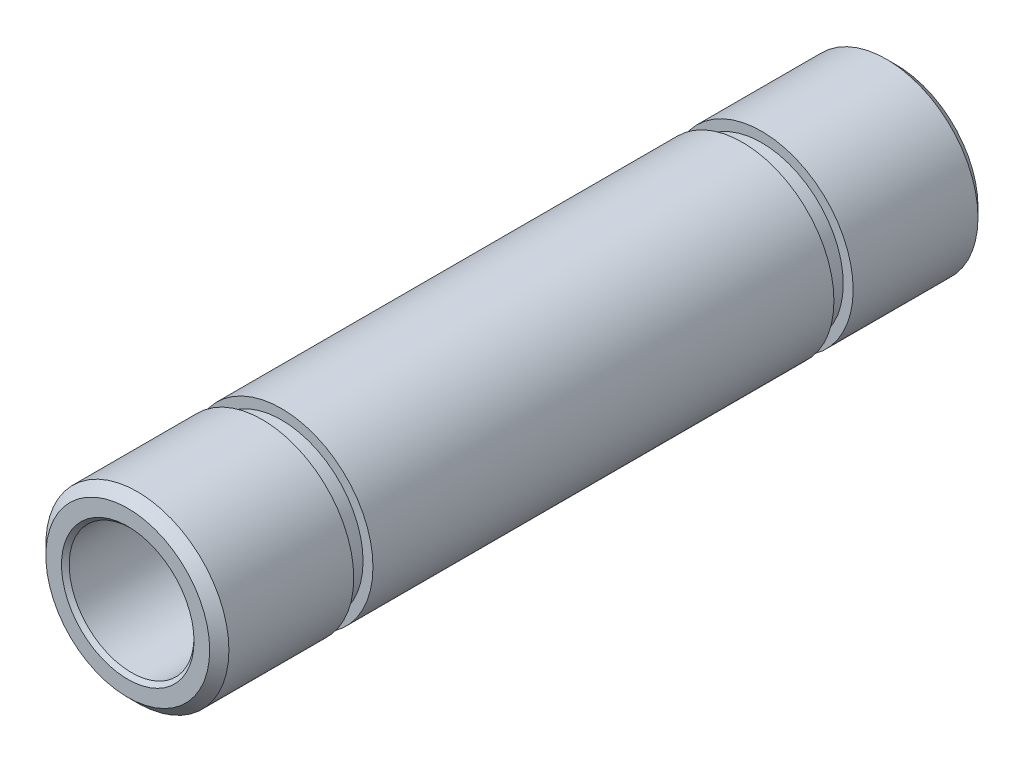
ISO-10303-21;
HEADER;
FILE_DESCRIPTION(('STEP AP214'),'2;1');
FILE_NAME('part.step','',(''),(''),'','','');
FILE_SCHEMA(('AUTOMOTIVE_DESIGN { 1 0 10303 214 1 1 1 1 }'));
ENDSEC;
DATA;
#1=APPLICATION_CONTEXT('core data for automotive mechanical design processes');
#2=APPLICATION_PROTOCOL_DEFINITION('international standard','automotive_design',2000,#1);
#3=PRODUCT_CONTEXT('',#1,'mechanical');
#4=PRODUCT('Part','Part','',(#3));
#5=PRODUCT_RELATED_PRODUCT_CATEGORY('part','',(#4));
#6=PRODUCT_DEFINITION_FORMATION('','',#4);
#7=PRODUCT_DEFINITION_CONTEXT('part definition',#1,'design');
#8=PRODUCT_DEFINITION('design','',#6,#7);
#9=PRODUCT_DEFINITION_SHAPE('','',#8);
#10=(LENGTH_UNIT() NAMED_UNIT(*) SI_UNIT(.MILLI.,.METRE.));
#11=(NAMED_UNIT(*) PLANE_ANGLE_UNIT() SI_UNIT($,.RADIAN.));
#12=(NAMED_UNIT(*) SI_UNIT($,.STERADIAN.) SOLID_ANGLE_UNIT());
#13=UNCERTAINTY_MEASURE_WITH_UNIT(LENGTH_MEASURE(1.E-05),#10,'distance_accuracy_value','');
#14=(GEOMETRIC_REPRESENTATION_CONTEXT(3) GLOBAL_UNCERTAINTY_ASSIGNED_CONTEXT((#13)) GLOBAL_UNIT_ASSIGNED_CONTEXT((#10,
#11,#12)) REPRESENTATION_CONTEXT('',''));
#15=CARTESIAN_POINT('',(0.,0.,0.));
#16=DIRECTION('',(0.,0.,1.));
#17=DIRECTION('',(1.,0.,0.));
#18=AXIS2_PLACEMENT_3D('',#15,#16,#17);
#19=CARTESIAN_POINT('',(0.,0.,-40.));
#20=DIRECTION('',(0.,0.,1.));
#21=DIRECTION('',(1.,0.,0.));
#22=AXIS2_PLACEMENT_3D('',#19,#20,#21);
#23=CYLINDRICAL_SURFACE('',#22,4.765);
#24=CARTESIAN_POINT('',(0.,0.,-39.5));
#25=DIRECTION('',(0.,0.,1.));
#26=DIRECTION('',(1.,0.,0.));
#27=AXIS2_PLACEMENT_3D('',#24,#25,#26);
#28=CIRCLE('',#27,4.765);
#29=CARTESIAN_POINT('',(4.765,0.,-39.5));
#30=VERTEX_POINT('',#29);
#31=EDGE_CURVE('E36',#30,#30,#28,.T.);
#32=ORIENTED_EDGE('',*,*,#31,.T.);
#33=EDGE_LOOP('',(#32));
#34=FACE_BOUND('',#33,.T.);
#35=CARTESIAN_POINT('',(0.,0.,-33.));
#36=DIRECTION('',(0.,0.,1.));
#37=DIRECTION('',(1.,0.,0.));
#38=AXIS2_PLACEMENT_3D('',#35,#36,#37);
#39=CIRCLE('',#38,4.765);
#40=CARTESIAN_POINT('',(4.765,0.,-33.));
#41=VERTEX_POINT('',#40);
#42=EDGE_CURVE('E58',#41,#41,#39,.T.);
#43=ORIENTED_EDGE('',*,*,#42,.F.);
#44=EDGE_LOOP('',(#43));
#45=FACE_BOUND('',#44,.T.);
#46=ADVANCED_FACE('F13',(#34,#45),#23,.T.);
#47=CARTESIAN_POINT('',(0.,0.,-32.));
#48=DIRECTION('',(0.,0.,1.));
#49=DIRECTION('',(1.,0.,0.));
#50=AXIS2_PLACEMENT_3D('',#47,#48,#49);
#51=CIRCLE('',#50,4.765);
#52=CARTESIAN_POINT('',(4.765,0.,-32.));
#53=VERTEX_POINT('',#52);
#54=EDGE_CURVE('E55',#53,#53,#51,.T.);
#55=ORIENTED_EDGE('',*,*,#54,.T.);
#56=EDGE_LOOP('',(#55));
#57=FACE_BOUND('',#56,.T.);
#58=CARTESIAN_POINT('',(0.,0.,-8.));
#59=DIRECTION('',(0.,0.,1.));
#60=DIRECTION('',(1.,0.,0.));
#61=AXIS2_PLACEMENT_3D('',#58,#59,#60);
#62=CIRCLE('',#61,4.765);
#63=CARTESIAN_POINT('',(4.765,0.,-8.));
#64=VERTEX_POINT('',#63);
#65=EDGE_CURVE('E45',#64,#64,#62,.T.);
#66=ORIENTED_EDGE('',*,*,#65,.F.);
#67=EDGE_LOOP('',(#66));
#68=FACE_BOUND('',#67,.T.);
#69=ADVANCED_FACE('F92',(#57,#68),#23,.T.);
#70=CARTESIAN_POINT('',(0.,0.,-0.500000000000007));
#71=DIRECTION('',(0.,0.,1.));
#72=DIRECTION('',(1.,0.,0.));
#73=AXIS2_PLACEMENT_3D('',#70,#71,#72);
#74=CIRCLE('',#73,4.765);
#75=CARTESIAN_POINT('',(4.765,0.,-0.500000000000007));
#76=VERTEX_POINT('',#75);
#77=EDGE_CURVE('E39',#76,#76,#74,.F.);
#78=ORIENTED_EDGE('',*,*,#77,.T.);
#79=EDGE_LOOP('',(#78));
#80=FACE_BOUND('',#79,.T.);
#81=CARTESIAN_POINT('',(0.,0.,-7.));
#82=DIRECTION('',(0.,0.,1.));
#83=DIRECTION('',(1.,0.,0.));
#84=AXIS2_PLACEMENT_3D('',#81,#82,#83);
#85=CIRCLE('',#84,4.765);
#86=CARTESIAN_POINT('',(4.765,0.,-7.));
#87=VERTEX_POINT('',#86);
#88=EDGE_CURVE('E46',#87,#87,#85,.T.);
#89=ORIENTED_EDGE('',*,*,#88,.T.);
#90=EDGE_LOOP('',(#89));
#91=FACE_BOUND('',#90,.T.);
#92=ADVANCED_FACE('F95',(#80,#91),#23,.T.);
#93=CARTESIAN_POINT('',(0.,0.,-40.));
#94=DIRECTION('',(0.,0.,1.));
#95=DIRECTION('',(1.,0.,0.));
#96=AXIS2_PLACEMENT_3D('',#93,#94,#95);
#97=PLANE('',#96);
#98=CARTESIAN_POINT('',(0.,0.,-40.));
#99=DIRECTION('',(0.,0.,1.));
#100=DIRECTION('',(1.,0.,0.));
#101=AXIS2_PLACEMENT_3D('',#98,#99,#100);
#102=CIRCLE('',#101,3.44999999999999);
#103=CARTESIAN_POINT('',(3.44999999999999,0.,-40.));
#104=VERTEX_POINT('',#103);
#105=EDGE_CURVE('E20',#104,#104,#102,.T.);
#106=ORIENTED_EDGE('',*,*,#105,.T.);
#107=EDGE_LOOP('',(#106));
#108=FACE_BOUND('',#107,.T.);
#109=CARTESIAN_POINT('',(0.,0.,-40.));
#110=DIRECTION('',(0.,0.,1.));
#111=DIRECTION('',(1.,0.,0.));
#112=AXIS2_PLACEMENT_3D('',#109,#110,#111);
#113=CIRCLE('',#112,4.26499999999999);
#114=CARTESIAN_POINT('',(4.26499999999999,0.,-40.));
#115=VERTEX_POINT('',#114);
#116=EDGE_CURVE('E33',#115,#115,#113,.F.);
#117=ORIENTED_EDGE('',*,*,#116,.T.);
#118=EDGE_LOOP('',(#117));
#119=FACE_BOUND('',#118,.T.);
#120=ADVANCED_FACE('F104',(#108,#119),#97,.F.);
#121=CARTESIAN_POINT('',(0.,0.,0.));
#122=DIRECTION('',(0.,0.,1.));
#123=DIRECTION('',(1.,0.,0.));
#124=AXIS2_PLACEMENT_3D('',#121,#122,#123);
#125=PLANE('',#124);
#126=CARTESIAN_POINT('',(0.,0.,0.));
#127=DIRECTION('',(0.,0.,1.));
#128=DIRECTION('',(1.,0.,0.));
#129=AXIS2_PLACEMENT_3D('',#126,#127,#128);
#130=CIRCLE('',#129,3.45000000000001);
#131=CARTESIAN_POINT('',(3.45000000000001,0.,0.));
#132=VERTEX_POINT('',#131);
#133=EDGE_CURVE('E24',#132,#132,#130,.F.);
#134=ORIENTED_EDGE('',*,*,#133,.T.);
#135=EDGE_LOOP('',(#134));
#136=FACE_BOUND('',#135,.T.);
#137=CARTESIAN_POINT('',(0.,0.,0.));
#138=DIRECTION('',(0.,0.,1.));
#139=DIRECTION('',(1.,0.,0.));
#140=AXIS2_PLACEMENT_3D('',#137,#138,#139);
#141=CIRCLE('',#140,4.265);
#142=CARTESIAN_POINT('',(4.265,0.,0.));
#143=VERTEX_POINT('',#142);
#144=EDGE_CURVE('E42',#143,#143,#141,.T.);
#145=ORIENTED_EDGE('',*,*,#144,.T.);
#146=EDGE_LOOP('',(#145));
#147=FACE_BOUND('',#146,.T.);
#148=ADVANCED_FACE('F109',(#136,#147),#125,.T.);
#149=CARTESIAN_POINT('',(0.,0.,-40.));
#150=DIRECTION('',(0.,0.,1.));
#151=DIRECTION('',(1.,0.,0.));
#152=AXIS2_PLACEMENT_3D('',#149,#150,#151);
#153=CYLINDRICAL_SURFACE('',#152,3.25);
#154=CARTESIAN_POINT('',(0.,0.,-39.8));
#155=DIRECTION('',(0.,0.,1.));
#156=DIRECTION('',(1.,0.,0.));
#157=AXIS2_PLACEMENT_3D('',#154,#155,#156);
#158=CIRCLE('',#157,3.25);
#159=CARTESIAN_POINT('',(3.25,0.,-39.8));
#160=VERTEX_POINT('',#159);
#161=EDGE_CURVE('E9',#160,#160,#158,.F.);
#162=ORIENTED_EDGE('',*,*,#161,.T.);
#163=EDGE_LOOP('',(#162));
#164=FACE_BOUND('',#163,.T.);
#165=CARTESIAN_POINT('',(0.,0.,-0.200000000000006));
#166=DIRECTION('',(0.,0.,1.));
#167=DIRECTION('',(1.,0.,0.));
#168=AXIS2_PLACEMENT_3D('',#165,#166,#167);
#169=CIRCLE('',#168,3.25);
#170=CARTESIAN_POINT('',(3.25,0.,-0.200000000000006));
#171=VERTEX_POINT('',#170);
#172=EDGE_CURVE('E28',#171,#171,#169,.T.);
#173=ORIENTED_EDGE('',*,*,#172,.T.);
#174=EDGE_LOOP('',(#173));
#175=FACE_BOUND('',#174,.T.);
#176=ADVANCED_FACE('F125',(#164,#175),#153,.F.);
#177=CARTESIAN_POINT('',(0.,0.,-8.));
#178=DIRECTION('',(0.,0.,1.));
#179=DIRECTION('',(1.,0.,0.));
#180=AXIS2_PLACEMENT_3D('',#177,#178,#179);
#181=PLANE('',#180);
#182=CARTESIAN_POINT('',(0.,0.,-8.));
#183=DIRECTION('',(0.,0.,1.));
#184=DIRECTION('',(1.,0.,0.));
#185=AXIS2_PLACEMENT_3D('',#182,#183,#184);
#186=CIRCLE('',#185,4.25);
#187=CARTESIAN_POINT('',(4.25,0.,-8.));
#188=VERTEX_POINT('',#187);
#189=EDGE_CURVE('E49',#188,#188,#186,.T.);
#190=ORIENTED_EDGE('',*,*,#189,.F.);
#191=EDGE_LOOP('',(#190));
#192=FACE_BOUND('',#191,.T.);
#193=ORIENTED_EDGE('',*,*,#65,.T.);
#194=EDGE_LOOP('',(#193));
#195=FACE_BOUND('',#194,.T.);
#196=ADVANCED_FACE('F117',(#192,#195),#181,.T.);
#197=CARTESIAN_POINT('',(0.,0.,-7.));
#198=DIRECTION('',(0.,0.,1.));
#199=DIRECTION('',(1.,0.,0.));
#200=AXIS2_PLACEMENT_3D('',#197,#198,#199);
#201=PLANE('',#200);
#202=CARTESIAN_POINT('',(0.,0.,-7.));
#203=DIRECTION('',(0.,0.,1.));
#204=DIRECTION('',(1.,0.,0.));
#205=AXIS2_PLACEMENT_3D('',#202,#203,#204);
#206=CIRCLE('',#205,4.25);
#207=CARTESIAN_POINT('',(4.25,0.,-7.));
#208=VERTEX_POINT('',#207);
#209=EDGE_CURVE('E52',#208,#208,#206,.T.);
#210=ORIENTED_EDGE('',*,*,#209,.T.);
#211=EDGE_LOOP('',(#210));
#212=FACE_BOUND('',#211,.T.);
#213=ORIENTED_EDGE('',*,*,#88,.F.);
#214=EDGE_LOOP('',(#213));
#215=FACE_BOUND('',#214,.T.);
#216=ADVANCED_FACE('F115',(#212,#215),#201,.F.);
#217=CARTESIAN_POINT('',(0.,0.,-8.));
#218=DIRECTION('',(0.,0.,1.));
#219=DIRECTION('',(1.,0.,0.));
#220=AXIS2_PLACEMENT_3D('',#217,#218,#219);
#221=CYLINDRICAL_SURFACE('',#220,4.25);
#222=ORIENTED_EDGE('',*,*,#189,.T.);
#223=EDGE_LOOP('',(#222));
#224=FACE_BOUND('',#223,.T.);
#225=ORIENTED_EDGE('',*,*,#209,.F.);
#226=EDGE_LOOP('',(#225));
#227=FACE_BOUND('',#226,.T.);
#228=ADVANCED_FACE('F87',(#224,#227),#221,.T.);
#229=CARTESIAN_POINT('',(0.,0.,-32.));
#230=DIRECTION('',(0.,0.,1.));
#231=DIRECTION('',(1.,0.,0.));
#232=AXIS2_PLACEMENT_3D('',#229,#230,#231);
#233=PLANE('',#232);
#234=ORIENTED_EDGE('',*,*,#54,.F.);
#235=EDGE_LOOP('',(#234));
#236=FACE_BOUND('',#235,.T.);
#237=CARTESIAN_POINT('',(0.,0.,-32.));
#238=DIRECTION('',(0.,0.,1.));
#239=DIRECTION('',(1.,0.,0.));
#240=AXIS2_PLACEMENT_3D('',#237,#238,#239);
#241=CIRCLE('',#240,4.25);
#242=CARTESIAN_POINT('',(4.25,0.,-32.));
#243=VERTEX_POINT('',#242);
#244=EDGE_CURVE('E61',#243,#243,#241,.T.);
#245=ORIENTED_EDGE('',*,*,#244,.T.);
#246=EDGE_LOOP('',(#245));
#247=FACE_BOUND('',#246,.T.);
#248=ADVANCED_FACE('F70',(#236,#247),#233,.F.);
#249=CARTESIAN_POINT('',(0.,0.,-33.));
#250=DIRECTION('',(0.,0.,1.));
#251=DIRECTION('',(1.,0.,0.));
#252=AXIS2_PLACEMENT_3D('',#249,#250,#251);
#253=PLANE('',#252);
#254=ORIENTED_EDGE('',*,*,#42,.T.);
#255=EDGE_LOOP('',(#254));
#256=FACE_BOUND('',#255,.T.);
#257=CARTESIAN_POINT('',(0.,0.,-33.));
#258=DIRECTION('',(0.,0.,1.));
#259=DIRECTION('',(1.,0.,0.));
#260=AXIS2_PLACEMENT_3D('',#257,#258,#259);
#261=CIRCLE('',#260,4.25);
#262=CARTESIAN_POINT('',(4.25,0.,-33.));
#263=VERTEX_POINT('',#262);
#264=EDGE_CURVE('E64',#263,#263,#261,.T.);
#265=ORIENTED_EDGE('',*,*,#264,.F.);
#266=EDGE_LOOP('',(#265));
#267=FACE_BOUND('',#266,.T.);
#268=ADVANCED_FACE('F76',(#256,#267),#253,.T.);
#269=CARTESIAN_POINT('',(0.,0.,-32.));
#270=DIRECTION('',(0.,0.,-1.));
#271=DIRECTION('',(-1.,0.,0.));
#272=AXIS2_PLACEMENT_3D('',#269,#270,#271);
#273=CYLINDRICAL_SURFACE('',#272,4.25);
#274=ORIENTED_EDGE('',*,*,#244,.F.);
#275=EDGE_LOOP('',(#274));
#276=FACE_BOUND('',#275,.T.);
#277=ORIENTED_EDGE('',*,*,#264,.T.);
#278=EDGE_LOOP('',(#277));
#279=FACE_BOUND('',#278,.T.);
#280=ADVANCED_FACE('F72',(#276,#279),#273,.T.);
#281=CARTESIAN_POINT('',(0.,0.,0.));
#282=DIRECTION('',(0.,0.,-1.));
#283=DIRECTION('',(-1.,0.,0.));
#284=AXIS2_PLACEMENT_3D('',#281,#282,#283);
#285=CONICAL_SURFACE('',#284,4.265,0.785398163397442);
#286=ORIENTED_EDGE('',*,*,#77,.F.);
#287=EDGE_LOOP('',(#286));
#288=FACE_BOUND('',#287,.T.);
#289=ORIENTED_EDGE('',*,*,#144,.F.);
#290=EDGE_LOOP('',(#289));
#291=FACE_BOUND('',#290,.T.);
#292=ADVANCED_FACE('F75',(#288,#291),#285,.T.);
#293=CARTESIAN_POINT('',(0.,0.,-39.5));
#294=DIRECTION('',(0.,0.,1.));
#295=DIRECTION('',(1.,0.,0.));
#296=AXIS2_PLACEMENT_3D('',#293,#294,#295);
#297=CONICAL_SURFACE('',#296,4.765,0.785398163397442);
#298=ORIENTED_EDGE('',*,*,#116,.F.);
#299=EDGE_LOOP('',(#298));
#300=FACE_BOUND('',#299,.T.);
#301=ORIENTED_EDGE('',*,*,#31,.F.);
#302=EDGE_LOOP('',(#301));
#303=FACE_BOUND('',#302,.T.);
#304=ADVANCED_FACE('F139',(#300,#303),#297,.T.);
#305=CARTESIAN_POINT('',(0.,0.,-0.200000000000006));
#306=DIRECTION('',(0.,0.,1.));
#307=DIRECTION('',(1.,0.,0.));
#308=AXIS2_PLACEMENT_3D('',#305,#306,#307);
#309=CONICAL_SURFACE('',#308,3.25,0.785398163397455);
#310=ORIENTED_EDGE('',*,*,#133,.F.);
#311=EDGE_LOOP('',(#310));
#312=FACE_BOUND('',#311,.T.);
#313=ORIENTED_EDGE('',*,*,#172,.F.);
#314=EDGE_LOOP('',(#313));
#315=FACE_BOUND('',#314,.T.);
#316=ADVANCED_FACE('F144',(#312,#315),#309,.F.);
#317=CARTESIAN_POINT('',(0.,0.,-40.));
#318=DIRECTION('',(0.,0.,-1.));
#319=DIRECTION('',(-1.,0.,0.));
#320=AXIS2_PLACEMENT_3D('',#317,#318,#319);
#321=CONICAL_SURFACE('',#320,3.44999999999999,0.785398163397438);
#322=ORIENTED_EDGE('',*,*,#161,.F.);
#323=EDGE_LOOP('',(#322));
#324=FACE_BOUND('',#323,.T.);
#325=ORIENTED_EDGE('',*,*,#105,.F.);
#326=EDGE_LOOP('',(#325));
#327=FACE_BOUND('',#326,.T.);
#328=ADVANCED_FACE('F15',(#324,#327),#321,.F.);
#329=CLOSED_SHELL('',(#46,#69,#92,#120,#148,#176,#196,#216,#228,#248,#268,#280,#292,#304,#316,#328));
#330=MANIFOLD_SOLID_BREP('B1',#329);
#331=ADVANCED_BREP_SHAPE_REPRESENTATION('',(#18,#330),#14);
#332=SHAPE_DEFINITION_REPRESENTATION(#9,#331);
ENDSEC;
END-ISO-10303-21;
